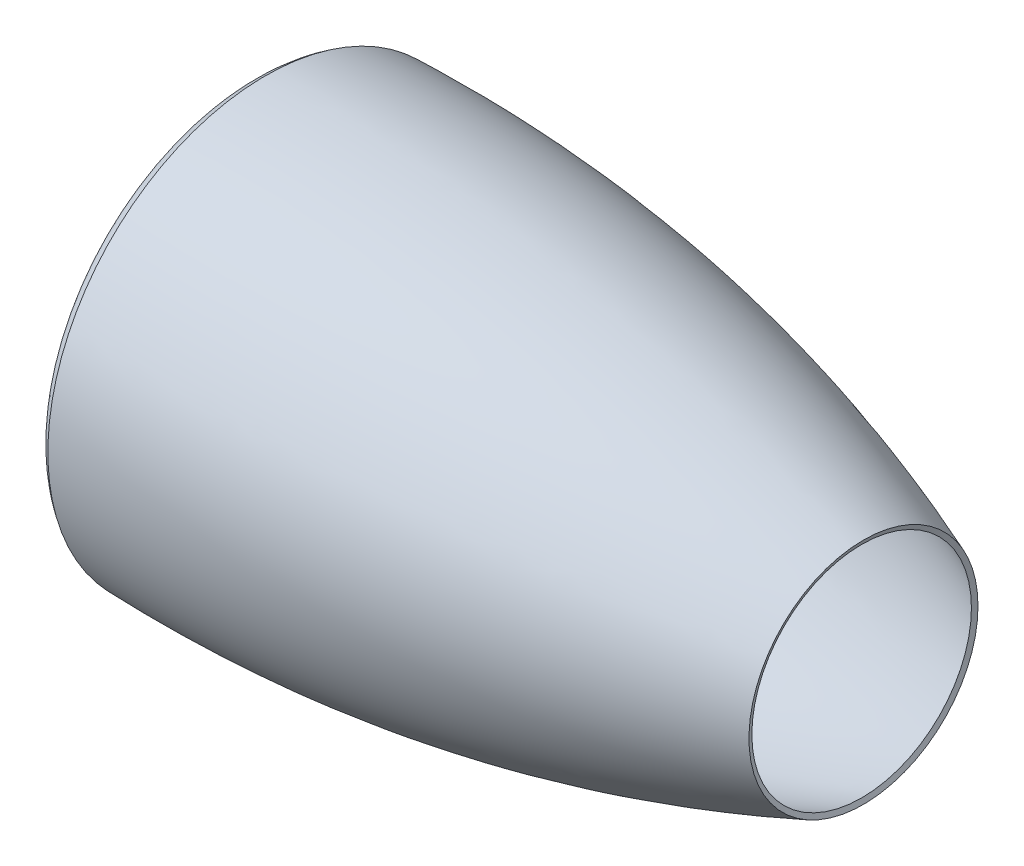
ISO-10303-21;
HEADER;
FILE_DESCRIPTION(('STEP AP214'),'2;1');
FILE_NAME('part.step','',(''),(''),'','','');
FILE_SCHEMA(('AUTOMOTIVE_DESIGN { 1 0 10303 214 1 1 1 1 }'));
ENDSEC;
DATA;
#1=APPLICATION_CONTEXT('core data for automotive mechanical design processes');
#2=APPLICATION_PROTOCOL_DEFINITION('international standard','automotive_design',2000,#1);
#3=PRODUCT_CONTEXT('',#1,'mechanical');
#4=PRODUCT('Part','Part','',(#3));
#5=PRODUCT_RELATED_PRODUCT_CATEGORY('part','',(#4));
#6=PRODUCT_DEFINITION_FORMATION('','',#4);
#7=PRODUCT_DEFINITION_CONTEXT('part definition',#1,'design');
#8=PRODUCT_DEFINITION('design','',#6,#7);
#9=PRODUCT_DEFINITION_SHAPE('','',#8);
#10=(LENGTH_UNIT() NAMED_UNIT(*) SI_UNIT(.MILLI.,.METRE.));
#11=(NAMED_UNIT(*) PLANE_ANGLE_UNIT() SI_UNIT($,.RADIAN.));
#12=(NAMED_UNIT(*) SI_UNIT($,.STERADIAN.) SOLID_ANGLE_UNIT());
#13=UNCERTAINTY_MEASURE_WITH_UNIT(LENGTH_MEASURE(1.E-05),#10,'distance_accuracy_value','');
#14=(GEOMETRIC_REPRESENTATION_CONTEXT(3) GLOBAL_UNCERTAINTY_ASSIGNED_CONTEXT((#13)) GLOBAL_UNIT_ASSIGNED_CONTEXT((#10,
#11,#12)) REPRESENTATION_CONTEXT('',''));
#15=CARTESIAN_POINT('',(0.,0.,0.));
#16=DIRECTION('',(0.,0.,1.));
#17=DIRECTION('',(1.,0.,0.));
#18=AXIS2_PLACEMENT_3D('',#15,#16,#17);
#19=CARTESIAN_POINT('',(58.1645223558109,0.,0.));
#20=DIRECTION('',(-1.,0.,0.));
#21=DIRECTION('',(0.,0.,1.));
#22=AXIS2_PLACEMENT_3D('',#19,#20,#21);
#23=PLANE('',#22);
#24=CARTESIAN_POINT('',(58.1645223558109,0.,0.));
#25=DIRECTION('',(1.,0.,0.));
#26=DIRECTION('',(0.,0.,-1.));
#27=AXIS2_PLACEMENT_3D('',#24,#25,#26);
#28=CIRCLE('',#27,185.);
#29=CARTESIAN_POINT('',(58.1645223558109,0.,-185.));
#30=VERTEX_POINT('',#29);
#31=EDGE_CURVE('E50',#30,#30,#28,.T.);
#32=ORIENTED_EDGE('',*,*,#31,.F.);
#33=EDGE_LOOP('',(#32));
#34=FACE_BOUND('',#33,.T.);
#35=CARTESIAN_POINT('',(58.1645223558109,0.,0.));
#36=DIRECTION('',(1.,0.,0.));
#37=DIRECTION('',(0.,0.,-1.));
#38=AXIS2_PLACEMENT_3D('',#35,#36,#37);
#39=CIRCLE('',#38,190.);
#40=CARTESIAN_POINT('',(58.1645223558109,0.,-190.));
#41=VERTEX_POINT('',#40);
#42=EDGE_CURVE('E113',#41,#41,#39,.T.);
#43=ORIENTED_EDGE('',*,*,#42,.T.);
#44=EDGE_LOOP('',(#43));
#45=FACE_BOUND('',#44,.T.);
#46=ADVANCED_FACE('F32',(#34,#45),#23,.F.);
#47=CARTESIAN_POINT('',(585.,0.,0.));
#48=DIRECTION('',(1.,0.,0.));
#49=DIRECTION('',(0.,0.,-1.));
#50=AXIS2_PLACEMENT_3D('',#47,#48,#49);
#51=CONICAL_SURFACE('',#50,108.,1.19814215002507);
#52=CARTESIAN_POINT('',(586.820443584575,0.,0.));
#53=DIRECTION('',(1.,0.,0.));
#54=DIRECTION('',(0.,1.,0.));
#55=AXIS2_PLACEMENT_3D('',#52,#53,#54);
#56=CIRCLE('',#55,112.656821357469);
#57=CARTESIAN_POINT('',(586.820443584575,112.656821357469,0.));
#58=VERTEX_POINT('',#57);
#59=EDGE_CURVE('E10',#58,#58,#56,.T.);
#60=ORIENTED_EDGE('',*,*,#59,.T.);
#61=EDGE_LOOP('',(#60));
#62=FACE_BOUND('',#61,.T.);
#63=CARTESIAN_POINT('',(585.,0.,0.));
#64=DIRECTION('',(1.,0.,0.));
#65=DIRECTION('',(0.,0.,-1.));
#66=AXIS2_PLACEMENT_3D('',#63,#64,#65);
#67=CIRCLE('',#66,108.);
#68=CARTESIAN_POINT('',(585.,0.,-108.));
#69=VERTEX_POINT('',#68);
#70=EDGE_CURVE('E35',#69,#69,#67,.T.);
#71=ORIENTED_EDGE('',*,*,#70,.F.);
#72=EDGE_LOOP('',(#71));
#73=FACE_BOUND('',#72,.T.);
#74=ADVANCED_FACE('F149',(#62,#73),#51,.F.);
#75=CARTESIAN_POINT('',(585.,108.,0.));
#76=CARTESIAN_POINT('',(303.114773614576,218.194510926818,0.));
#77=CARTESIAN_POINT('',(-3.03114773614576,208.971326764644,0.));
#78=CARTESIAN_POINT('',(-6.06229547229152,208.880008109573,0.));
#79=B_SPLINE_CURVE_WITH_KNOTS('',2,(#75,#76,#77,#78),.UNSPECIFIED.,.F.,.F.,(3,1,3),(0.,1.,1.01),.UNSPECIFIED.);
#80=CARTESIAN_POINT('',(0.,0.,0.));
#81=DIRECTION('',(1.,0.,0.));
#82=AXIS1_PLACEMENT('',#80,#81);
#83=SURFACE_OF_REVOLUTION('',#79,#82);
#84=OFFSET_SURFACE('',#83,-5.,.F.);
#85=CARTESIAN_POINT('',(-1.54033882422677,0.,0.));
#86=DIRECTION('',(1.,0.,0.));
#87=DIRECTION('',(0.,0.,-1.));
#88=AXIS2_PLACEMENT_3D('',#85,#86,#87);
#89=CIRCLE('',#88,214.018508543612);
#90=CARTESIAN_POINT('',(-1.54033882422677,0.,-214.018508543612));
#91=VERTEX_POINT('',#90);
#92=EDGE_CURVE('E39',#91,#91,#89,.T.);
#93=ORIENTED_EDGE('',*,*,#92,.T.);
#94=EDGE_LOOP('',(#93));
#95=FACE_BOUND('',#94,.T.);
#96=ORIENTED_EDGE('',*,*,#59,.F.);
#97=EDGE_LOOP('',(#96));
#98=FACE_BOUND('',#97,.T.);
#99=ADVANCED_FACE('F69',(#95,#98),#84,.F.);
#100=CARTESIAN_POINT('',(1.16864730837052,209.815962394741,0.));
#101=CARTESIAN_POINT('',(0.584323654185261,209.439303907228,0.));
#102=CARTESIAN_POINT('',(-22.1993539020124,194.752810442813,0.));
#103=CARTESIAN_POINT('',(0.628765060773345,179.582147669901,0.));
#104=CARTESIAN_POINT('',(1.25753012154669,179.164295339802,0.));
#105=B_SPLINE_CURVE_WITH_KNOTS('',2,(#100,#101,#102,#103,#104),.UNSPECIFIED.,.F.,.F.,(3,1,1,3),
(-0.0263216513761822,0.,1.,1.02832357480081),.UNSPECIFIED.);
#106=CARTESIAN_POINT('',(0.,0.,0.));
#107=DIRECTION('',(1.,0.,0.));
#108=AXIS1_PLACEMENT('',#106,#107);
#109=SURFACE_OF_REVOLUTION('',#105,#108);
#110=OFFSET_SURFACE('',#109,-5.,.F.);
#111=CARTESIAN_POINT('',(-1.50989545521355,0.,0.));
#112=DIRECTION('',(1.,0.,0.));
#113=DIRECTION('',(0.,0.,-1.));
#114=AXIS2_PLACEMENT_3D('',#111,#112,#113);
#115=CIRCLE('',#114,175.);
#116=CARTESIAN_POINT('',(-1.50989545521355,0.,-175.));
#117=VERTEX_POINT('',#116);
#118=EDGE_CURVE('E44',#117,#117,#115,.T.);
#119=ORIENTED_EDGE('',*,*,#118,.T.);
#120=EDGE_LOOP('',(#119));
#121=FACE_BOUND('',#120,.T.);
#122=ORIENTED_EDGE('',*,*,#92,.F.);
#123=EDGE_LOOP('',(#122));
#124=FACE_BOUND('',#123,.T.);
#125=ADVANCED_FACE('F70',(#121,#124),#110,.F.);
#126=CARTESIAN_POINT('',(0.,0.,0.));
#127=DIRECTION('',(1.,0.,0.));
#128=DIRECTION('',(0.,0.,-1.));
#129=AXIS2_PLACEMENT_3D('',#126,#127,#128);
#130=CYLINDRICAL_SURFACE('',#129,175.);
#131=CARTESIAN_POINT('',(27.3725708357595,0.,0.));
#132=DIRECTION('',(1.,0.,0.));
#133=DIRECTION('',(0.,0.,-1.));
#134=AXIS2_PLACEMENT_3D('',#131,#132,#133);
#135=CIRCLE('',#134,175.);
#136=CARTESIAN_POINT('',(27.3725708357595,0.,-175.));
#137=VERTEX_POINT('',#136);
#138=EDGE_CURVE('E53',#137,#137,#135,.T.);
#139=ORIENTED_EDGE('',*,*,#138,.T.);
#140=EDGE_LOOP('',(#139));
#141=FACE_BOUND('',#140,.T.);
#142=ORIENTED_EDGE('',*,*,#118,.F.);
#143=EDGE_LOOP('',(#142));
#144=FACE_BOUND('',#143,.T.);
#145=ADVANCED_FACE('F73',(#141,#144),#130,.F.);
#146=CARTESIAN_POINT('',(28.8730674860437,0.,0.));
#147=DIRECTION('',(1.,0.,0.));
#148=DIRECTION('',(0.,0.,-1.));
#149=AXIS2_PLACEMENT_3D('',#146,#147,#148);
#150=CONICAL_SURFACE('',#149,176.837825392463,0.886103731578635);
#151=CARTESIAN_POINT('',(35.5370931915704,0.,0.));
#152=DIRECTION('',(1.,0.,0.));
#153=DIRECTION('',(0.,0.,-1.));
#154=AXIS2_PLACEMENT_3D('',#151,#152,#153);
#155=CIRCLE('',#154,185.);
#156=CARTESIAN_POINT('',(35.5370931915704,0.,-185.));
#157=VERTEX_POINT('',#156);
#158=EDGE_CURVE('E48',#157,#157,#155,.T.);
#159=ORIENTED_EDGE('',*,*,#158,.T.);
#160=EDGE_LOOP('',(#159));
#161=FACE_BOUND('',#160,.T.);
#162=ORIENTED_EDGE('',*,*,#138,.F.);
#163=EDGE_LOOP('',(#162));
#164=FACE_BOUND('',#163,.T.);
#165=ADVANCED_FACE('F79',(#161,#164),#150,.F.);
#166=CARTESIAN_POINT('',(0.,0.,0.));
#167=DIRECTION('',(1.,0.,0.));
#168=DIRECTION('',(0.,0.,-1.));
#169=AXIS2_PLACEMENT_3D('',#166,#167,#168);
#170=CYLINDRICAL_SURFACE('',#169,185.);
#171=ORIENTED_EDGE('',*,*,#31,.T.);
#172=EDGE_LOOP('',(#171));
#173=FACE_BOUND('',#172,.T.);
#174=ORIENTED_EDGE('',*,*,#158,.F.);
#175=EDGE_LOOP('',(#174));
#176=FACE_BOUND('',#175,.T.);
#177=ADVANCED_FACE('F83',(#173,#176),#170,.F.);
#178=CARTESIAN_POINT('',(585.,108.,0.));
#179=CARTESIAN_POINT('',(303.114773614576,218.194510926818,0.));
#180=CARTESIAN_POINT('',(0.,209.062645419715,0.));
#181=B_SPLINE_CURVE_WITH_KNOTS('',2,(#178,#179,#180),.UNSPECIFIED.,.F.,.F.,(3,3),(0.,1.),.UNSPECIFIED.);
#182=CARTESIAN_POINT('',(0.,0.,0.));
#183=DIRECTION('',(1.,0.,0.));
#184=AXIS1_PLACEMENT('',#182,#183);
#185=SURFACE_OF_REVOLUTION('',#181,#184);
#186=CARTESIAN_POINT('',(0.,0.,0.));
#187=DIRECTION('',(1.,0.,0.));
#188=DIRECTION('',(0.,0.,-1.));
#189=AXIS2_PLACEMENT_3D('',#186,#187,#188);
#190=CIRCLE('',#189,209.062645419715);
#191=CARTESIAN_POINT('',(0.,0.,-209.062645419715));
#192=VERTEX_POINT('',#191);
#193=EDGE_CURVE('E127',#192,#192,#190,.T.);
#194=ORIENTED_EDGE('',*,*,#193,.F.);
#195=EDGE_LOOP('',(#194));
#196=FACE_BOUND('',#195,.T.);
#197=ORIENTED_EDGE('',*,*,#70,.T.);
#198=EDGE_LOOP('',(#197));
#199=FACE_BOUND('',#198,.T.);
#200=ADVANCED_FACE('F87',(#196,#199),#185,.T.);
#201=CARTESIAN_POINT('',(0.,209.062645419715,0.));
#202=CARTESIAN_POINT('',(-22.1993539020124,194.752810442813,0.));
#203=CARTESIAN_POINT('',(0.,180.,0.));
#204=B_SPLINE_CURVE_WITH_KNOTS('',2,(#201,#202,#203),.UNSPECIFIED.,.F.,.F.,(3,3),(0.,1.),.UNSPECIFIED.);
#205=CARTESIAN_POINT('',(0.,0.,0.));
#206=DIRECTION('',(1.,0.,0.));
#207=AXIS1_PLACEMENT('',#205,#206);
#208=SURFACE_OF_REVOLUTION('',#204,#207);
#209=CARTESIAN_POINT('',(0.,0.,0.));
#210=DIRECTION('',(1.,0.,0.));
#211=DIRECTION('',(0.,0.,-1.));
#212=AXIS2_PLACEMENT_3D('',#209,#210,#211);
#213=CIRCLE('',#212,180.);
#214=CARTESIAN_POINT('',(0.,0.,-180.));
#215=VERTEX_POINT('',#214);
#216=EDGE_CURVE('E125',#215,#215,#213,.T.);
#217=ORIENTED_EDGE('',*,*,#216,.F.);
#218=EDGE_LOOP('',(#217));
#219=FACE_BOUND('',#218,.T.);
#220=ORIENTED_EDGE('',*,*,#193,.T.);
#221=EDGE_LOOP('',(#220));
#222=FACE_BOUND('',#221,.T.);
#223=ADVANCED_FACE('F100',(#219,#222),#208,.T.);
#224=CARTESIAN_POINT('',(0.,0.,0.));
#225=DIRECTION('',(1.,0.,0.));
#226=DIRECTION('',(0.,0.,-1.));
#227=AXIS2_PLACEMENT_3D('',#224,#225,#226);
#228=CYLINDRICAL_SURFACE('',#227,180.);
#229=CARTESIAN_POINT('',(25.,0.,0.));
#230=DIRECTION('',(1.,0.,0.));
#231=DIRECTION('',(0.,0.,-1.));
#232=AXIS2_PLACEMENT_3D('',#229,#230,#231);
#233=CIRCLE('',#232,180.);
#234=CARTESIAN_POINT('',(25.,0.,-180.));
#235=VERTEX_POINT('',#234);
#236=EDGE_CURVE('E119',#235,#235,#233,.T.);
#237=ORIENTED_EDGE('',*,*,#236,.F.);
#238=EDGE_LOOP('',(#237));
#239=FACE_BOUND('',#238,.T.);
#240=ORIENTED_EDGE('',*,*,#216,.T.);
#241=EDGE_LOOP('',(#240));
#242=FACE_BOUND('',#241,.T.);
#243=ADVANCED_FACE('F96',(#239,#242),#228,.T.);
#244=CARTESIAN_POINT('',(25.,0.,0.));
#245=DIRECTION('',(1.,0.,0.));
#246=DIRECTION('',(0.,0.,-1.));
#247=AXIS2_PLACEMENT_3D('',#244,#245,#246);
#248=CONICAL_SURFACE('',#247,180.,0.886103731578635);
#249=CARTESIAN_POINT('',(33.1645223558109,0.,0.));
#250=DIRECTION('',(1.,0.,0.));
#251=DIRECTION('',(0.,0.,-1.));
#252=AXIS2_PLACEMENT_3D('',#249,#250,#251);
#253=CIRCLE('',#252,190.);
#254=CARTESIAN_POINT('',(33.1645223558109,0.,-190.));
#255=VERTEX_POINT('',#254);
#256=EDGE_CURVE('E120',#255,#255,#253,.T.);
#257=ORIENTED_EDGE('',*,*,#256,.F.);
#258=EDGE_LOOP('',(#257));
#259=FACE_BOUND('',#258,.T.);
#260=ORIENTED_EDGE('',*,*,#236,.T.);
#261=EDGE_LOOP('',(#260));
#262=FACE_BOUND('',#261,.T.);
#263=ADVANCED_FACE('F92',(#259,#262),#248,.T.);
#264=CARTESIAN_POINT('',(0.,0.,0.));
#265=DIRECTION('',(1.,0.,0.));
#266=DIRECTION('',(0.,0.,-1.));
#267=AXIS2_PLACEMENT_3D('',#264,#265,#266);
#268=CYLINDRICAL_SURFACE('',#267,190.);
#269=ORIENTED_EDGE('',*,*,#42,.F.);
#270=EDGE_LOOP('',(#269));
#271=FACE_BOUND('',#270,.T.);
#272=ORIENTED_EDGE('',*,*,#256,.T.);
#273=EDGE_LOOP('',(#272));
#274=FACE_BOUND('',#273,.T.);
#275=ADVANCED_FACE('F89',(#271,#274),#268,.T.);
#276=CLOSED_SHELL('',(#46,#74,#99,#125,#145,#165,#177,#200,#223,#243,#263,#275));
#277=MANIFOLD_SOLID_BREP('B2',#276);
#278=ADVANCED_BREP_SHAPE_REPRESENTATION('',(#18,#277),#14);
#279=SHAPE_DEFINITION_REPRESENTATION(#9,#278);
ENDSEC;
END-ISO-10303-21;
